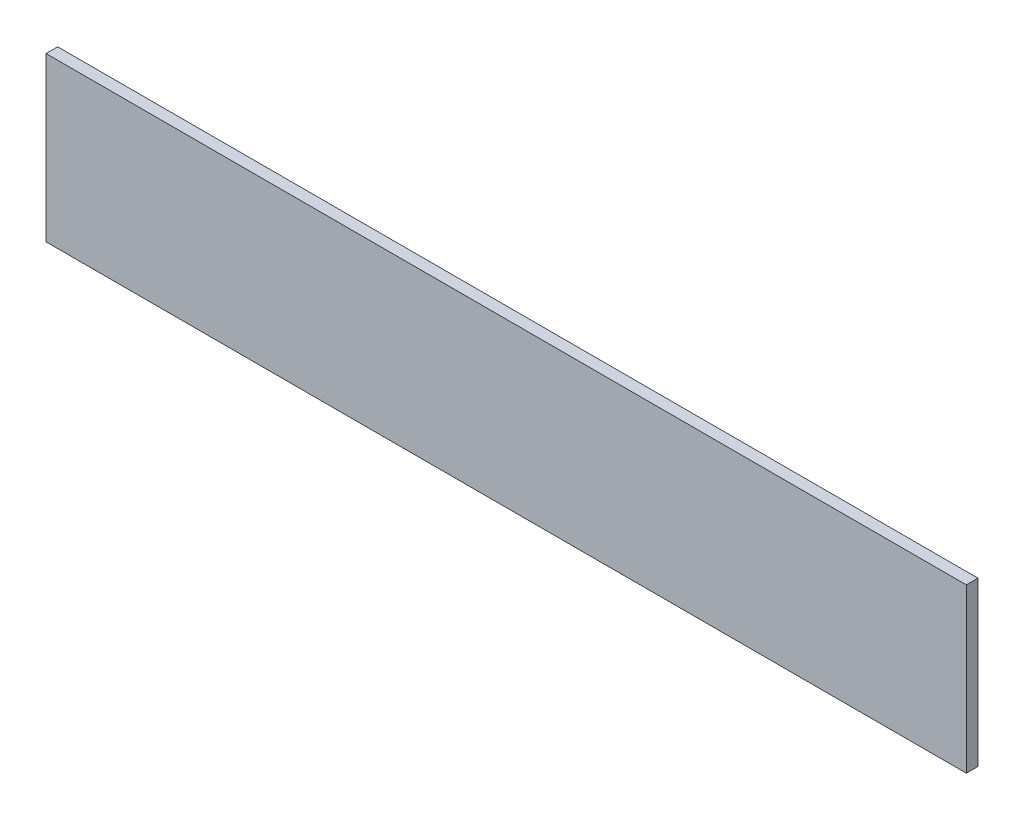
ISO-10303-21;
HEADER;
FILE_DESCRIPTION(('STEP AP214'),'2;1');
FILE_NAME('part.step','',(''),(''),'','','');
FILE_SCHEMA(('AUTOMOTIVE_DESIGN { 1 0 10303 214 1 1 1 1 }'));
ENDSEC;
DATA;
#1=APPLICATION_CONTEXT('core data for automotive mechanical design processes');
#2=APPLICATION_PROTOCOL_DEFINITION('international standard','automotive_design',2000,#1);
#3=PRODUCT_CONTEXT('',#1,'mechanical');
#4=PRODUCT('Part','Part','',(#3));
#5=PRODUCT_RELATED_PRODUCT_CATEGORY('part','',(#4));
#6=PRODUCT_DEFINITION_FORMATION('','',#4);
#7=PRODUCT_DEFINITION_CONTEXT('part definition',#1,'design');
#8=PRODUCT_DEFINITION('design','',#6,#7);
#9=PRODUCT_DEFINITION_SHAPE('','',#8);
#10=(LENGTH_UNIT() NAMED_UNIT(*) SI_UNIT(.MILLI.,.METRE.));
#11=(NAMED_UNIT(*) PLANE_ANGLE_UNIT() SI_UNIT($,.RADIAN.));
#12=(NAMED_UNIT(*) SI_UNIT($,.STERADIAN.) SOLID_ANGLE_UNIT());
#13=UNCERTAINTY_MEASURE_WITH_UNIT(LENGTH_MEASURE(1.E-05),#10,'distance_accuracy_value','');
#14=(GEOMETRIC_REPRESENTATION_CONTEXT(3) GLOBAL_UNCERTAINTY_ASSIGNED_CONTEXT((#13)) GLOBAL_UNIT_ASSIGNED_CONTEXT((#10,
#11,#12)) REPRESENTATION_CONTEXT('',''));
#15=CARTESIAN_POINT('',(0.,0.,0.));
#16=DIRECTION('',(0.,0.,1.));
#17=DIRECTION('',(1.,0.,0.));
#18=AXIS2_PLACEMENT_3D('',#15,#16,#17);
#19=CARTESIAN_POINT('',(225.425,46.0375,6.35));
#20=DIRECTION('',(0.,0.,1.));
#21=DIRECTION('',(1.,0.,0.));
#22=AXIS2_PLACEMENT_3D('',#19,#20,#21);
#23=PLANE('',#22);
#24=DIRECTION('',(0.,1.,0.));
#25=VECTOR('',#24,1.);
#26=CARTESIAN_POINT('',(476.25,90.4875,6.35));
#27=LINE('',#26,#25);
#28=CARTESIAN_POINT('',(476.25,90.4875,6.35));
#29=VERTEX_POINT('',#28);
#30=CARTESIAN_POINT('',(476.25,1.58750000000004,6.35));
#31=VERTEX_POINT('',#30);
#32=EDGE_CURVE('E68',#29,#31,#27,.F.);
#33=ORIENTED_EDGE('',*,*,#32,.F.);
#34=DIRECTION('',(1.,0.,0.));
#35=VECTOR('',#34,1.);
#36=CARTESIAN_POINT('',(-25.4,90.4875,6.35));
#37=LINE('',#36,#35);
#38=CARTESIAN_POINT('',(-25.4,90.4875,6.35));
#39=VERTEX_POINT('',#38);
#40=EDGE_CURVE('E20',#39,#29,#37,.T.);
#41=ORIENTED_EDGE('',*,*,#40,.F.);
#42=DIRECTION('',(0.,1.,0.));
#43=VECTOR('',#42,1.);
#44=CARTESIAN_POINT('',(-25.4,1.5875,6.35));
#45=LINE('',#44,#43);
#46=CARTESIAN_POINT('',(-25.4,1.58750000000005,6.35));
#47=VERTEX_POINT('',#46);
#48=EDGE_CURVE('E58',#47,#39,#45,.T.);
#49=ORIENTED_EDGE('',*,*,#48,.F.);
#50=DIRECTION('',(1.,0.,0.));
#51=VECTOR('',#50,1.);
#52=CARTESIAN_POINT('',(476.25,1.58750000000005,6.35));
#53=LINE('',#52,#51);
#54=EDGE_CURVE('E53',#31,#47,#53,.F.);
#55=ORIENTED_EDGE('',*,*,#54,.F.);
#56=EDGE_LOOP('',(#33,#41,#49,#55));
#57=FACE_BOUND('',#56,.T.);
#58=ADVANCED_FACE('F17',(#57),#23,.T.);
#59=CARTESIAN_POINT('',(-25.4,90.4875,0.));
#60=DIRECTION('',(0.,1.,0.));
#61=DIRECTION('',(0.,0.,1.));
#62=AXIS2_PLACEMENT_3D('',#59,#60,#61);
#63=PLANE('',#62);
#64=ORIENTED_EDGE('',*,*,#40,.T.);
#65=DIRECTION('',(0.,0.,-1.));
#66=VECTOR('',#65,1.);
#67=CARTESIAN_POINT('',(476.25,90.4875,0.));
#68=LINE('',#67,#66);
#69=CARTESIAN_POINT('',(476.25,90.4875,0.));
#70=VERTEX_POINT('',#69);
#71=EDGE_CURVE('E79',#70,#29,#68,.F.);
#72=ORIENTED_EDGE('',*,*,#71,.F.);
#73=DIRECTION('',(1.,0.,0.));
#74=VECTOR('',#73,1.);
#75=CARTESIAN_POINT('',(225.425,90.4875,0.));
#76=LINE('',#75,#74);
#77=CARTESIAN_POINT('',(-25.4,90.4875,0.));
#78=VERTEX_POINT('',#77);
#79=EDGE_CURVE('E74',#70,#78,#76,.F.);
#80=ORIENTED_EDGE('',*,*,#79,.T.);
#81=DIRECTION('',(0.,0.,1.));
#82=VECTOR('',#81,1.);
#83=CARTESIAN_POINT('',(-25.4,90.4875,0.));
#84=LINE('',#83,#82);
#85=EDGE_CURVE('E63',#39,#78,#84,.F.);
#86=ORIENTED_EDGE('',*,*,#85,.F.);
#87=EDGE_LOOP('',(#64,#72,#80,#86));
#88=FACE_BOUND('',#87,.T.);
#89=ADVANCED_FACE('F73',(#88),#63,.T.);
#90=CARTESIAN_POINT('',(-25.4,1.5875,0.));
#91=DIRECTION('',(-1.,0.,0.));
#92=DIRECTION('',(0.,0.,1.));
#93=AXIS2_PLACEMENT_3D('',#90,#91,#92);
#94=PLANE('',#93);
#95=ORIENTED_EDGE('',*,*,#48,.T.);
#96=ORIENTED_EDGE('',*,*,#85,.T.);
#97=DIRECTION('',(0.,1.,0.));
#98=VECTOR('',#97,1.);
#99=CARTESIAN_POINT('',(-25.4,46.0375,0.));
#100=LINE('',#99,#98);
#101=CARTESIAN_POINT('',(-25.4,1.58750000000005,0.));
#102=VERTEX_POINT('',#101);
#103=EDGE_CURVE('E84',#78,#102,#100,.F.);
#104=ORIENTED_EDGE('',*,*,#103,.T.);
#105=DIRECTION('',(0.,0.,-1.));
#106=VECTOR('',#105,1.);
#107=CARTESIAN_POINT('',(-25.4,1.58750000000005,0.));
#108=LINE('',#107,#106);
#109=EDGE_CURVE('E65',#47,#102,#108,.T.);
#110=ORIENTED_EDGE('',*,*,#109,.F.);
#111=EDGE_LOOP('',(#95,#96,#104,#110));
#112=FACE_BOUND('',#111,.T.);
#113=ADVANCED_FACE('F60',(#112),#94,.T.);
#114=CARTESIAN_POINT('',(476.25,1.58750000000005,0.));
#115=DIRECTION('',(0.,-1.,0.));
#116=DIRECTION('',(0.,0.,-1.));
#117=AXIS2_PLACEMENT_3D('',#114,#115,#116);
#118=PLANE('',#117);
#119=ORIENTED_EDGE('',*,*,#54,.T.);
#120=ORIENTED_EDGE('',*,*,#109,.T.);
#121=DIRECTION('',(1.,0.,0.));
#122=VECTOR('',#121,1.);
#123=CARTESIAN_POINT('',(225.425,1.58750000000005,0.));
#124=LINE('',#123,#122);
#125=CARTESIAN_POINT('',(476.25,1.58750000000004,0.));
#126=VERTEX_POINT('',#125);
#127=EDGE_CURVE('E26',#102,#126,#124,.T.);
#128=ORIENTED_EDGE('',*,*,#127,.T.);
#129=DIRECTION('',(0.,0.,-1.));
#130=VECTOR('',#129,1.);
#131=CARTESIAN_POINT('',(476.25,1.58750000000003,0.));
#132=LINE('',#131,#130);
#133=EDGE_CURVE('E34',#31,#126,#132,.T.);
#134=ORIENTED_EDGE('',*,*,#133,.F.);
#135=EDGE_LOOP('',(#119,#120,#128,#134));
#136=FACE_BOUND('',#135,.T.);
#137=ADVANCED_FACE('F88',(#136),#118,.T.);
#138=CARTESIAN_POINT('',(476.25,90.4875,0.));
#139=DIRECTION('',(1.,0.,0.));
#140=DIRECTION('',(0.,0.,-1.));
#141=AXIS2_PLACEMENT_3D('',#138,#139,#140);
#142=PLANE('',#141);
#143=ORIENTED_EDGE('',*,*,#32,.T.);
#144=ORIENTED_EDGE('',*,*,#133,.T.);
#145=DIRECTION('',(0.,1.,0.));
#146=VECTOR('',#145,1.);
#147=CARTESIAN_POINT('',(476.25,46.0375,0.));
#148=LINE('',#147,#146);
#149=EDGE_CURVE('E11',#126,#70,#148,.T.);
#150=ORIENTED_EDGE('',*,*,#149,.T.);
#151=ORIENTED_EDGE('',*,*,#71,.T.);
#152=EDGE_LOOP('',(#143,#144,#150,#151));
#153=FACE_BOUND('',#152,.T.);
#154=ADVANCED_FACE('F91',(#153),#142,.T.);
#155=CARTESIAN_POINT('',(225.425,46.0375,0.));
#156=DIRECTION('',(0.,0.,1.));
#157=DIRECTION('',(1.,0.,0.));
#158=AXIS2_PLACEMENT_3D('',#155,#156,#157);
#159=PLANE('',#158);
#160=ORIENTED_EDGE('',*,*,#127,.F.);
#161=ORIENTED_EDGE('',*,*,#103,.F.);
#162=ORIENTED_EDGE('',*,*,#79,.F.);
#163=ORIENTED_EDGE('',*,*,#149,.F.);
#164=EDGE_LOOP('',(#160,#161,#162,#163));
#165=FACE_BOUND('',#164,.T.);
#166=ADVANCED_FACE('F90',(#165),#159,.F.);
#167=CLOSED_SHELL('',(#58,#89,#113,#137,#154,#166));
#168=MANIFOLD_SOLID_BREP('B1',#167);
#169=ADVANCED_BREP_SHAPE_REPRESENTATION('',(#18,#168),#14);
#170=SHAPE_DEFINITION_REPRESENTATION(#9,#169);
ENDSEC;
END-ISO-10303-21;
